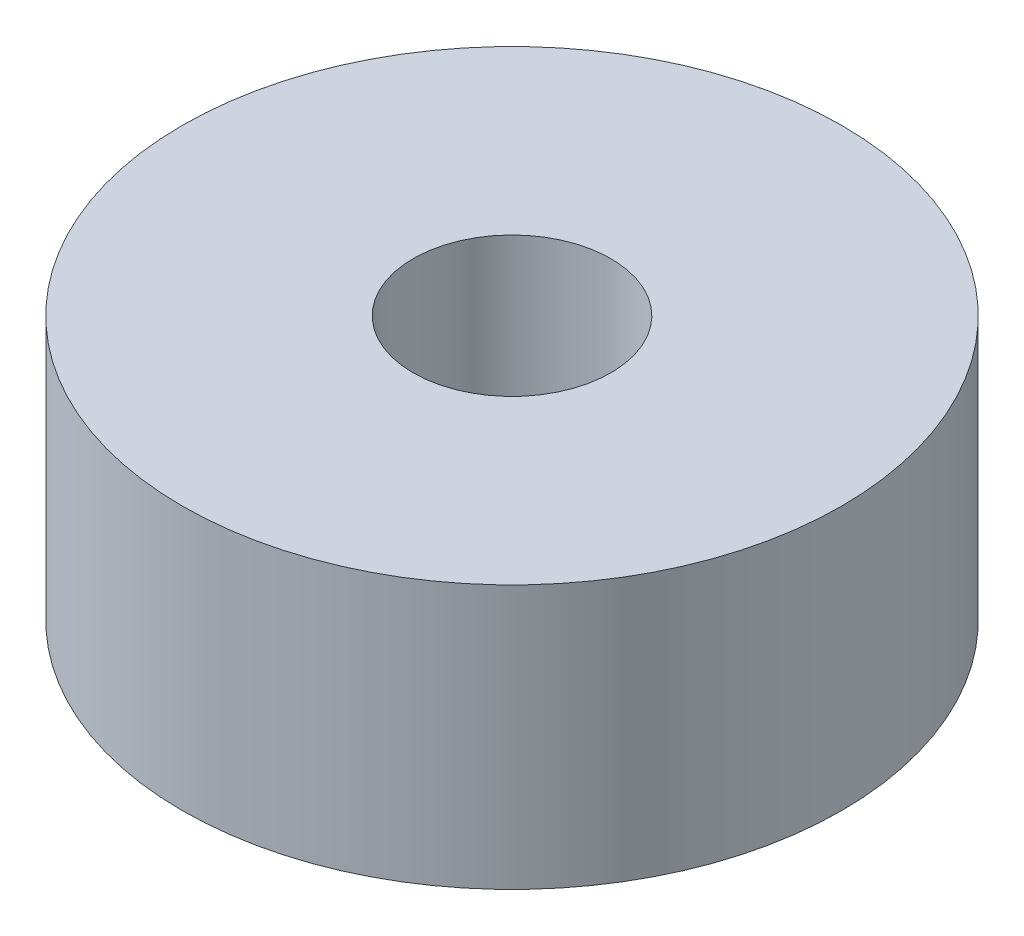
ISO-10303-21;
HEADER;
FILE_DESCRIPTION(('STEP AP214'),'2;1');
FILE_NAME('part.step','',(''),(''),'','','');
FILE_SCHEMA(('AUTOMOTIVE_DESIGN { 1 0 10303 214 1 1 1 1 }'));
ENDSEC;
DATA;
#1=APPLICATION_CONTEXT('core data for automotive mechanical design processes');
#2=APPLICATION_PROTOCOL_DEFINITION('international standard','automotive_design',2000,#1);
#3=PRODUCT_CONTEXT('',#1,'mechanical');
#4=PRODUCT('Part','Part','',(#3));
#5=PRODUCT_RELATED_PRODUCT_CATEGORY('part','',(#4));
#6=PRODUCT_DEFINITION_FORMATION('','',#4);
#7=PRODUCT_DEFINITION_CONTEXT('part definition',#1,'design');
#8=PRODUCT_DEFINITION('design','',#6,#7);
#9=PRODUCT_DEFINITION_SHAPE('','',#8);
#10=(LENGTH_UNIT() NAMED_UNIT(*) SI_UNIT(.MILLI.,.METRE.));
#11=(NAMED_UNIT(*) PLANE_ANGLE_UNIT() SI_UNIT($,.RADIAN.));
#12=(NAMED_UNIT(*) SI_UNIT($,.STERADIAN.) SOLID_ANGLE_UNIT());
#13=UNCERTAINTY_MEASURE_WITH_UNIT(LENGTH_MEASURE(1.E-05),#10,'distance_accuracy_value','');
#14=(GEOMETRIC_REPRESENTATION_CONTEXT(3) GLOBAL_UNCERTAINTY_ASSIGNED_CONTEXT((#13)) GLOBAL_UNIT_ASSIGNED_CONTEXT((#10,
#11,#12)) REPRESENTATION_CONTEXT('',''));
#15=CARTESIAN_POINT('',(0.,0.,0.));
#16=DIRECTION('',(0.,0.,1.));
#17=DIRECTION('',(1.,0.,0.));
#18=AXIS2_PLACEMENT_3D('',#15,#16,#17);
#19=CARTESIAN_POINT('',(0.,4.,0.));
#20=DIRECTION('',(0.,1.,0.));
#21=DIRECTION('',(0.,0.,1.));
#22=AXIS2_PLACEMENT_3D('',#19,#20,#21);
#23=PLANE('',#22);
#24=CARTESIAN_POINT('',(0.,4.,0.));
#25=DIRECTION('',(0.,1.,0.));
#26=DIRECTION('',(0.,0.,1.));
#27=AXIS2_PLACEMENT_3D('',#24,#25,#26);
#28=CIRCLE('',#27,5.);
#29=CARTESIAN_POINT('',(0.,4.,5.));
#30=VERTEX_POINT('',#29);
#31=EDGE_CURVE('E10',#30,#30,#28,.T.);
#32=ORIENTED_EDGE('',*,*,#31,.T.);
#33=EDGE_LOOP('',(#32));
#34=FACE_BOUND('',#33,.T.);
#35=CARTESIAN_POINT('',(0.,4.,0.));
#36=DIRECTION('',(0.,1.,0.));
#37=DIRECTION('',(0.,0.,1.));
#38=AXIS2_PLACEMENT_3D('',#35,#36,#37);
#39=CIRCLE('',#38,1.5);
#40=CARTESIAN_POINT('',(0.,4.,1.5));
#41=VERTEX_POINT('',#40);
#42=EDGE_CURVE('E45',#41,#41,#39,.T.);
#43=ORIENTED_EDGE('',*,*,#42,.F.);
#44=EDGE_LOOP('',(#43));
#45=FACE_BOUND('',#44,.T.);
#46=ADVANCED_FACE('F34',(#34,#45),#23,.T.);
#47=CARTESIAN_POINT('',(0.,0.,0.));
#48=DIRECTION('',(0.,1.,0.));
#49=DIRECTION('',(0.,0.,1.));
#50=AXIS2_PLACEMENT_3D('',#47,#48,#49);
#51=PLANE('',#50);
#52=CARTESIAN_POINT('',(0.,0.,0.));
#53=DIRECTION('',(0.,1.,0.));
#54=DIRECTION('',(0.,0.,1.));
#55=AXIS2_PLACEMENT_3D('',#52,#53,#54);
#56=CIRCLE('',#55,5.);
#57=CARTESIAN_POINT('',(0.,0.,5.));
#58=VERTEX_POINT('',#57);
#59=EDGE_CURVE('E38',#58,#58,#56,.T.);
#60=ORIENTED_EDGE('',*,*,#59,.F.);
#61=EDGE_LOOP('',(#60));
#62=FACE_BOUND('',#61,.T.);
#63=CARTESIAN_POINT('',(0.,0.,0.));
#64=DIRECTION('',(0.,1.,0.));
#65=DIRECTION('',(0.,0.,1.));
#66=AXIS2_PLACEMENT_3D('',#63,#64,#65);
#67=CIRCLE('',#66,1.5);
#68=CARTESIAN_POINT('',(0.,0.,1.5));
#69=VERTEX_POINT('',#68);
#70=EDGE_CURVE('E47',#69,#69,#67,.T.);
#71=ORIENTED_EDGE('',*,*,#70,.T.);
#72=EDGE_LOOP('',(#71));
#73=FACE_BOUND('',#72,.T.);
#74=ADVANCED_FACE('F57',(#62,#73),#51,.F.);
#75=CARTESIAN_POINT('',(0.,4.,0.));
#76=DIRECTION('',(0.,-1.,0.));
#77=DIRECTION('',(0.,0.,-1.));
#78=AXIS2_PLACEMENT_3D('',#75,#76,#77);
#79=CYLINDRICAL_SURFACE('',#78,5.);
#80=ORIENTED_EDGE('',*,*,#31,.F.);
#81=EDGE_LOOP('',(#80));
#82=FACE_BOUND('',#81,.T.);
#83=ORIENTED_EDGE('',*,*,#59,.T.);
#84=EDGE_LOOP('',(#83));
#85=FACE_BOUND('',#84,.T.);
#86=ADVANCED_FACE('F36',(#82,#85),#79,.T.);
#87=CARTESIAN_POINT('',(0.,4.,0.));
#88=DIRECTION('',(0.,-1.,0.));
#89=DIRECTION('',(0.,0.,-1.));
#90=AXIS2_PLACEMENT_3D('',#87,#88,#89);
#91=CYLINDRICAL_SURFACE('',#90,1.5);
#92=ORIENTED_EDGE('',*,*,#42,.T.);
#93=EDGE_LOOP('',(#92));
#94=FACE_BOUND('',#93,.T.);
#95=ORIENTED_EDGE('',*,*,#70,.F.);
#96=EDGE_LOOP('',(#95));
#97=FACE_BOUND('',#96,.T.);
#98=ADVANCED_FACE('F53',(#94,#97),#91,.F.);
#99=CLOSED_SHELL('',(#46,#74,#86,#98));
#100=MANIFOLD_SOLID_BREP('B2',#99);
#101=ADVANCED_BREP_SHAPE_REPRESENTATION('',(#18,#100),#14);
#102=SHAPE_DEFINITION_REPRESENTATION(#9,#101);
ENDSEC;
END-ISO-10303-21;
